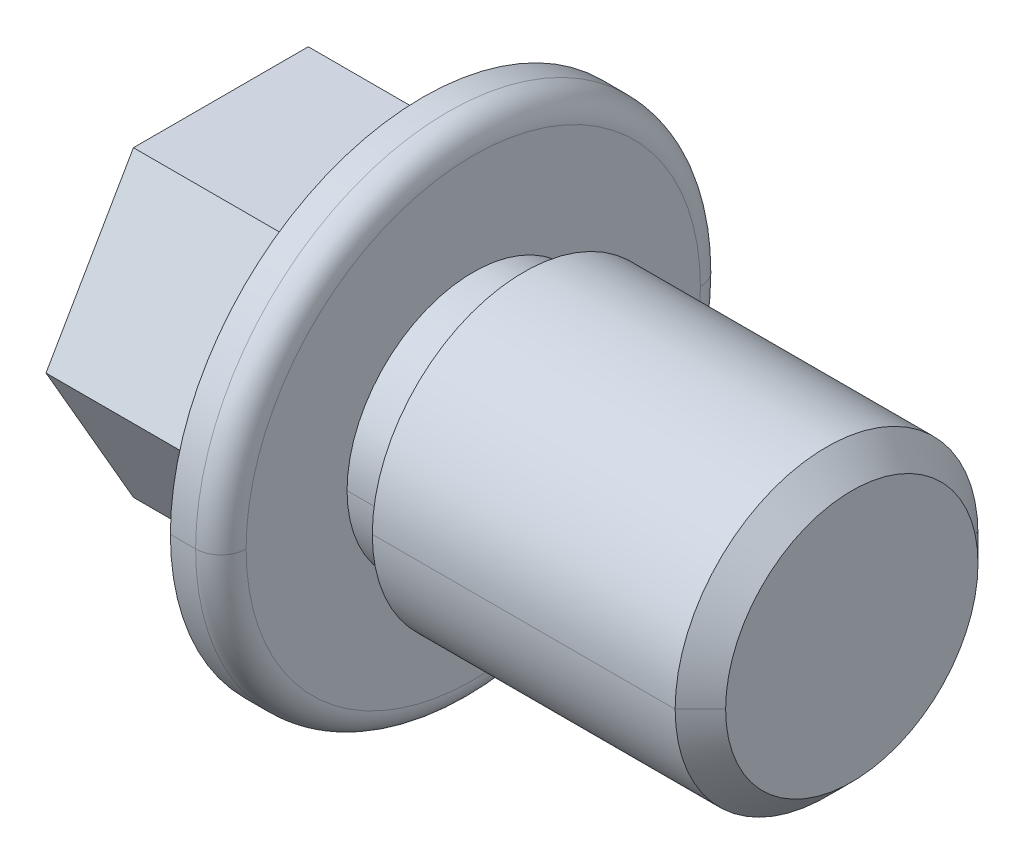
ISO-10303-21;
HEADER;
FILE_DESCRIPTION(('STEP AP214'),'2;1');
FILE_NAME('part.step','',(''),(''),'','','');
FILE_SCHEMA(('AUTOMOTIVE_DESIGN { 1 0 10303 214 1 1 1 1 }'));
ENDSEC;
DATA;
#1=APPLICATION_CONTEXT('core data for automotive mechanical design processes');
#2=APPLICATION_PROTOCOL_DEFINITION('international standard','automotive_design',2000,#1);
#3=PRODUCT_CONTEXT('',#1,'mechanical');
#4=PRODUCT('Part','Part','',(#3));
#5=PRODUCT_RELATED_PRODUCT_CATEGORY('part','',(#4));
#6=PRODUCT_DEFINITION_FORMATION('','',#4);
#7=PRODUCT_DEFINITION_CONTEXT('part definition',#1,'design');
#8=PRODUCT_DEFINITION('design','',#6,#7);
#9=PRODUCT_DEFINITION_SHAPE('','',#8);
#10=(LENGTH_UNIT() NAMED_UNIT(*) SI_UNIT(.MILLI.,.METRE.));
#11=(NAMED_UNIT(*) PLANE_ANGLE_UNIT() SI_UNIT($,.RADIAN.));
#12=(NAMED_UNIT(*) SI_UNIT($,.STERADIAN.) SOLID_ANGLE_UNIT());
#13=UNCERTAINTY_MEASURE_WITH_UNIT(LENGTH_MEASURE(1.E-05),#10,'distance_accuracy_value','');
#14=(GEOMETRIC_REPRESENTATION_CONTEXT(3) GLOBAL_UNCERTAINTY_ASSIGNED_CONTEXT((#13)) GLOBAL_UNIT_ASSIGNED_CONTEXT((#10,
#11,#12)) REPRESENTATION_CONTEXT('',''));
#15=CARTESIAN_POINT('',(0.,0.,0.));
#16=DIRECTION('',(0.,0.,1.));
#17=DIRECTION('',(1.,0.,0.));
#18=AXIS2_PLACEMENT_3D('',#15,#16,#17);
#19=CARTESIAN_POINT('',(-103.,-122.5,-62.));
#20=DIRECTION('',(1.,0.,0.));
#21=DIRECTION('',(0.,0.,-1.));
#22=AXIS2_PLACEMENT_3D('',#19,#20,#21);
#23=PLANE('',#22);
#24=CARTESIAN_POINT('',(-103.,-122.5,-62.));
#25=DIRECTION('',(1.,0.,0.));
#26=DIRECTION('',(0.,0.,-1.));
#27=AXIS2_PLACEMENT_3D('',#24,#25,#26);
#28=CIRCLE('',#27,6.);
#29=CARTESIAN_POINT('',(-103.,-122.5,-68.));
#30=VERTEX_POINT('',#29);
#31=CARTESIAN_POINT('',(-103.,-122.5,-56.));
#32=VERTEX_POINT('',#31);
#33=EDGE_CURVE('E137',#30,#32,#28,.T.);
#34=ORIENTED_EDGE('',*,*,#33,.F.);
#35=CARTESIAN_POINT('',(-103.,-122.5,-62.));
#36=DIRECTION('',(1.,0.,0.));
#37=DIRECTION('',(0.,0.,-1.));
#38=AXIS2_PLACEMENT_3D('',#35,#36,#37);
#39=CIRCLE('',#38,6.);
#40=EDGE_CURVE('E36',#32,#30,#39,.T.);
#41=ORIENTED_EDGE('',*,*,#40,.F.);
#42=EDGE_LOOP('',(#34,#41));
#43=FACE_BOUND('',#42,.T.);
#44=CARTESIAN_POINT('',(-103.,-122.5,-62.));
#45=DIRECTION('',(1.,0.,0.));
#46=DIRECTION('',(0.,0.,-1.));
#47=AXIS2_PLACEMENT_3D('',#44,#45,#46);
#48=CIRCLE('',#47,5.);
#49=CARTESIAN_POINT('',(-103.,-122.5,-67.));
#50=VERTEX_POINT('',#49);
#51=CARTESIAN_POINT('',(-103.,-122.5,-57.));
#52=VERTEX_POINT('',#51);
#53=EDGE_CURVE('E11',#50,#52,#48,.T.);
#54=ORIENTED_EDGE('',*,*,#53,.T.);
#55=CARTESIAN_POINT('',(-103.,-122.5,-62.));
#56=DIRECTION('',(1.,0.,0.));
#57=DIRECTION('',(0.,0.,-1.));
#58=AXIS2_PLACEMENT_3D('',#55,#56,#57);
#59=CIRCLE('',#58,5.);
#60=EDGE_CURVE('E27',#52,#50,#59,.T.);
#61=ORIENTED_EDGE('',*,*,#60,.T.);
#62=EDGE_LOOP('',(#54,#61));
#63=FACE_BOUND('',#62,.T.);
#64=ADVANCED_FACE('F17',(#43,#63),#23,.F.);
#65=CARTESIAN_POINT('',(-104.,-122.5,-62.));
#66=DIRECTION('',(1.,0.,0.));
#67=DIRECTION('',(0.,0.,1.));
#68=AXIS2_PLACEMENT_3D('',#65,#66,#67);
#69=CYLINDRICAL_SURFACE('',#68,5.);
#70=DIRECTION('',(1.,0.,0.));
#71=VECTOR('',#70,1.);
#72=CARTESIAN_POINT('',(-104.,-122.5,-57.));
#73=LINE('',#72,#71);
#74=CARTESIAN_POINT('',(-105.,-122.5,-57.));
#75=VERTEX_POINT('',#74);
#76=EDGE_CURVE('E158',#75,#52,#73,.T.);
#77=ORIENTED_EDGE('',*,*,#76,.F.);
#78=CARTESIAN_POINT('',(-105.,-122.5,-62.));
#79=DIRECTION('',(1.,0.,0.));
#80=DIRECTION('',(0.,0.,-1.));
#81=AXIS2_PLACEMENT_3D('',#78,#79,#80);
#82=CIRCLE('',#81,5.);
#83=CARTESIAN_POINT('',(-105.,-122.5,-67.));
#84=VERTEX_POINT('',#83);
#85=EDGE_CURVE('E157',#75,#84,#82,.T.);
#86=ORIENTED_EDGE('',*,*,#85,.T.);
#87=DIRECTION('',(1.,0.,0.));
#88=VECTOR('',#87,1.);
#89=CARTESIAN_POINT('',(-104.,-122.5,-67.));
#90=LINE('',#89,#88);
#91=EDGE_CURVE('E165',#84,#50,#90,.T.);
#92=ORIENTED_EDGE('',*,*,#91,.T.);
#93=ORIENTED_EDGE('',*,*,#60,.F.);
#94=EDGE_LOOP('',(#77,#86,#92,#93));
#95=FACE_BOUND('',#94,.T.);
#96=ADVANCED_FACE('F258',(#95),#69,.T.);
#97=CARTESIAN_POINT('',(-104.,-122.5,-62.));
#98=DIRECTION('',(1.,0.,0.));
#99=DIRECTION('',(0.,0.,1.));
#100=AXIS2_PLACEMENT_3D('',#97,#98,#99);
#101=CYLINDRICAL_SURFACE('',#100,5.);
#102=ORIENTED_EDGE('',*,*,#91,.F.);
#103=CARTESIAN_POINT('',(-105.,-122.5,-62.));
#104=DIRECTION('',(1.,0.,0.));
#105=DIRECTION('',(0.,0.,-1.));
#106=AXIS2_PLACEMENT_3D('',#103,#104,#105);
#107=CIRCLE('',#106,5.);
#108=EDGE_CURVE('E161',#84,#75,#107,.T.);
#109=ORIENTED_EDGE('',*,*,#108,.T.);
#110=ORIENTED_EDGE('',*,*,#76,.T.);
#111=ORIENTED_EDGE('',*,*,#53,.F.);
#112=EDGE_LOOP('',(#102,#109,#110,#111));
#113=FACE_BOUND('',#112,.T.);
#114=ADVANCED_FACE('F256',(#113),#101,.T.);
#115=CARTESIAN_POINT('',(-107.,-122.5,-62.));
#116=DIRECTION('',(-1.,0.,0.));
#117=DIRECTION('',(0.,0.,-1.));
#118=AXIS2_PLACEMENT_3D('',#115,#116,#117);
#119=PLANE('',#118);
#120=CARTESIAN_POINT('',(-107.,-122.5,-62.));
#121=DIRECTION('',(1.,0.,0.));
#122=DIRECTION('',(0.,0.,1.));
#123=AXIS2_PLACEMENT_3D('',#120,#121,#122);
#124=CIRCLE('',#123,10.);
#125=CARTESIAN_POINT('',(-107.,-122.5,-72.));
#126=VERTEX_POINT('',#125);
#127=CARTESIAN_POINT('',(-107.,-122.5,-52.));
#128=VERTEX_POINT('',#127);
#129=EDGE_CURVE('E170',#126,#128,#124,.T.);
#130=ORIENTED_EDGE('',*,*,#129,.F.);
#131=CARTESIAN_POINT('',(-107.,-122.5,-62.));
#132=DIRECTION('',(1.,0.,0.));
#133=DIRECTION('',(0.,0.,1.));
#134=AXIS2_PLACEMENT_3D('',#131,#132,#133);
#135=CIRCLE('',#134,10.);
#136=EDGE_CURVE('E174',#128,#126,#135,.T.);
#137=ORIENTED_EDGE('',*,*,#136,.F.);
#138=EDGE_LOOP('',(#130,#137));
#139=FACE_BOUND('',#138,.T.);
#140=DIRECTION('',(0.,-0.866025403784329,-0.50000000000019));
#141=VECTOR('',#140,1.);
#142=CARTESIAN_POINT('',(-107.,-119.5,-67.19615242271));
#143=LINE('',#142,#141);
#144=CARTESIAN_POINT('',(-107.,-116.5,-65.46410161514));
#145=VERTEX_POINT('',#144);
#146=CARTESIAN_POINT('',(-107.,-122.5,-68.92820323028));
#147=VERTEX_POINT('',#146);
#148=EDGE_CURVE('E162',#145,#147,#143,.T.);
#149=ORIENTED_EDGE('',*,*,#148,.F.);
#150=DIRECTION('',(0.,0.,-1.));
#151=VECTOR('',#150,1.);
#152=CARTESIAN_POINT('',(-107.,-116.5,-62.));
#153=LINE('',#152,#151);
#154=CARTESIAN_POINT('',(-107.,-116.5,-58.53589838486));
#155=VERTEX_POINT('',#154);
#156=EDGE_CURVE('E181',#155,#145,#153,.T.);
#157=ORIENTED_EDGE('',*,*,#156,.F.);
#158=DIRECTION('',(0.,0.866025403784329,-0.50000000000019));
#159=VECTOR('',#158,1.);
#160=CARTESIAN_POINT('',(-107.,-119.5,-56.80384757729));
#161=LINE('',#160,#159);
#162=CARTESIAN_POINT('',(-107.,-122.5,-55.07179676972));
#163=VERTEX_POINT('',#162);
#164=EDGE_CURVE('E184',#163,#155,#161,.T.);
#165=ORIENTED_EDGE('',*,*,#164,.F.);
#166=DIRECTION('',(0.,0.866025403784329,0.50000000000019));
#167=VECTOR('',#166,1.);
#168=CARTESIAN_POINT('',(-107.,-125.5,-56.80384757729));
#169=LINE('',#168,#167);
#170=CARTESIAN_POINT('',(-107.,-128.5,-58.53589838486));
#171=VERTEX_POINT('',#170);
#172=EDGE_CURVE('E187',#171,#163,#169,.T.);
#173=ORIENTED_EDGE('',*,*,#172,.F.);
#174=DIRECTION('',(0.,0.,1.));
#175=VECTOR('',#174,1.);
#176=CARTESIAN_POINT('',(-107.,-128.5,-62.));
#177=LINE('',#176,#175);
#178=CARTESIAN_POINT('',(-107.,-128.5,-65.46410161514));
#179=VERTEX_POINT('',#178);
#180=EDGE_CURVE('E190',#179,#171,#177,.T.);
#181=ORIENTED_EDGE('',*,*,#180,.F.);
#182=DIRECTION('',(0.,-0.866025403784329,0.50000000000019));
#183=VECTOR('',#182,1.);
#184=CARTESIAN_POINT('',(-107.,-125.5,-67.19615242271));
#185=LINE('',#184,#183);
#186=EDGE_CURVE('E193',#147,#179,#185,.T.);
#187=ORIENTED_EDGE('',*,*,#186,.F.);
#188=EDGE_LOOP('',(#149,#157,#165,#173,#181,#187));
#189=FACE_BOUND('',#188,.T.);
#190=ADVANCED_FACE('F271',(#139,#189),#119,.T.);
#191=CARTESIAN_POINT('',(-115.,-116.5,-65.46410161514));
#192=DIRECTION('',(0.,-0.50000000000019,0.866025403784329));
#193=DIRECTION('',(0.,0.866025403784329,0.50000000000019));
#194=AXIS2_PLACEMENT_3D('',#191,#192,#193);
#195=PLANE('',#194);
#196=ORIENTED_EDGE('',*,*,#148,.T.);
#197=DIRECTION('',(1.,0.,0.));
#198=VECTOR('',#197,1.);
#199=CARTESIAN_POINT('',(-111.,-122.5,-68.92820323028));
#200=LINE('',#199,#198);
#201=CARTESIAN_POINT('',(-115.,-122.5,-68.92820323028));
#202=VERTEX_POINT('',#201);
#203=EDGE_CURVE('E195',#202,#147,#200,.T.);
#204=ORIENTED_EDGE('',*,*,#203,.F.);
#205=DIRECTION('',(0.,-0.866025403784329,-0.50000000000019));
#206=VECTOR('',#205,1.);
#207=CARTESIAN_POINT('',(-115.,-119.5,-67.19615242271));
#208=LINE('',#207,#206);
#209=CARTESIAN_POINT('',(-115.,-116.5,-65.46410161514));
#210=VERTEX_POINT('',#209);
#211=EDGE_CURVE('E199',#210,#202,#208,.T.);
#212=ORIENTED_EDGE('',*,*,#211,.F.);
#213=DIRECTION('',(1.,0.,0.));
#214=VECTOR('',#213,1.);
#215=CARTESIAN_POINT('',(-111.,-116.5,-65.46410161514));
#216=LINE('',#215,#214);
#217=EDGE_CURVE('E180',#210,#145,#216,.T.);
#218=ORIENTED_EDGE('',*,*,#217,.T.);
#219=EDGE_LOOP('',(#196,#204,#212,#218));
#220=FACE_BOUND('',#219,.T.);
#221=ADVANCED_FACE('F274',(#220),#195,.F.);
#222=CARTESIAN_POINT('',(-115.,-116.5,-58.53589838486));
#223=DIRECTION('',(0.,-1.,0.));
#224=DIRECTION('',(0.,0.,1.));
#225=AXIS2_PLACEMENT_3D('',#222,#223,#224);
#226=PLANE('',#225);
#227=ORIENTED_EDGE('',*,*,#156,.T.);
#228=ORIENTED_EDGE('',*,*,#217,.F.);
#229=DIRECTION('',(0.,0.,-1.));
#230=VECTOR('',#229,1.);
#231=CARTESIAN_POINT('',(-115.,-116.5,-62.));
#232=LINE('',#231,#230);
#233=CARTESIAN_POINT('',(-115.,-116.5,-58.53589838486));
#234=VERTEX_POINT('',#233);
#235=EDGE_CURVE('E201',#234,#210,#232,.T.);
#236=ORIENTED_EDGE('',*,*,#235,.F.);
#237=DIRECTION('',(1.,0.,0.));
#238=VECTOR('',#237,1.);
#239=CARTESIAN_POINT('',(-111.,-116.5,-58.53589838486));
#240=LINE('',#239,#238);
#241=EDGE_CURVE('E183',#234,#155,#240,.T.);
#242=ORIENTED_EDGE('',*,*,#241,.T.);
#243=EDGE_LOOP('',(#227,#228,#236,#242));
#244=FACE_BOUND('',#243,.T.);
#245=ADVANCED_FACE('F278',(#244),#226,.F.);
#246=CARTESIAN_POINT('',(-115.,-122.5,-55.07179676972));
#247=DIRECTION('',(0.,-0.50000000000019,-0.866025403784329));
#248=DIRECTION('',(0.,-0.866025403784329,0.50000000000019));
#249=AXIS2_PLACEMENT_3D('',#246,#247,#248);
#250=PLANE('',#249);
#251=ORIENTED_EDGE('',*,*,#164,.T.);
#252=ORIENTED_EDGE('',*,*,#241,.F.);
#253=DIRECTION('',(0.,0.866025403784329,-0.50000000000019));
#254=VECTOR('',#253,1.);
#255=CARTESIAN_POINT('',(-115.,-119.5,-56.80384757729));
#256=LINE('',#255,#254);
#257=CARTESIAN_POINT('',(-115.,-122.5,-55.07179676972));
#258=VERTEX_POINT('',#257);
#259=EDGE_CURVE('E207',#258,#234,#256,.T.);
#260=ORIENTED_EDGE('',*,*,#259,.F.);
#261=DIRECTION('',(1.,0.,0.));
#262=VECTOR('',#261,1.);
#263=CARTESIAN_POINT('',(-111.,-122.5,-55.07179676972));
#264=LINE('',#263,#262);
#265=EDGE_CURVE('E186',#258,#163,#264,.T.);
#266=ORIENTED_EDGE('',*,*,#265,.T.);
#267=EDGE_LOOP('',(#251,#252,#260,#266));
#268=FACE_BOUND('',#267,.T.);
#269=ADVANCED_FACE('F282',(#268),#250,.F.);
#270=CARTESIAN_POINT('',(-115.,-128.5,-58.53589838486));
#271=DIRECTION('',(0.,0.50000000000019,-0.866025403784329));
#272=DIRECTION('',(0.,-0.866025403784329,-0.50000000000019));
#273=AXIS2_PLACEMENT_3D('',#270,#271,#272);
#274=PLANE('',#273);
#275=ORIENTED_EDGE('',*,*,#172,.T.);
#276=ORIENTED_EDGE('',*,*,#265,.F.);
#277=DIRECTION('',(0.,0.866025403784329,0.50000000000019));
#278=VECTOR('',#277,1.);
#279=CARTESIAN_POINT('',(-115.,-125.5,-56.80384757729));
#280=LINE('',#279,#278);
#281=CARTESIAN_POINT('',(-115.,-128.5,-58.53589838486));
#282=VERTEX_POINT('',#281);
#283=EDGE_CURVE('E212',#282,#258,#280,.T.);
#284=ORIENTED_EDGE('',*,*,#283,.F.);
#285=DIRECTION('',(1.,0.,0.));
#286=VECTOR('',#285,1.);
#287=CARTESIAN_POINT('',(-111.,-128.5,-58.53589838486));
#288=LINE('',#287,#286);
#289=EDGE_CURVE('E189',#282,#171,#288,.T.);
#290=ORIENTED_EDGE('',*,*,#289,.T.);
#291=EDGE_LOOP('',(#275,#276,#284,#290));
#292=FACE_BOUND('',#291,.T.);
#293=ADVANCED_FACE('F286',(#292),#274,.F.);
#294=CARTESIAN_POINT('',(-115.,-128.5,-65.46410161514));
#295=DIRECTION('',(0.,1.,0.));
#296=DIRECTION('',(0.,0.,-1.));
#297=AXIS2_PLACEMENT_3D('',#294,#295,#296);
#298=PLANE('',#297);
#299=ORIENTED_EDGE('',*,*,#180,.T.);
#300=ORIENTED_EDGE('',*,*,#289,.F.);
#301=DIRECTION('',(0.,0.,1.));
#302=VECTOR('',#301,1.);
#303=CARTESIAN_POINT('',(-115.,-128.5,-62.));
#304=LINE('',#303,#302);
#305=CARTESIAN_POINT('',(-115.,-128.5,-65.46410161514));
#306=VERTEX_POINT('',#305);
#307=EDGE_CURVE('E198',#306,#282,#304,.T.);
#308=ORIENTED_EDGE('',*,*,#307,.F.);
#309=DIRECTION('',(1.,0.,0.));
#310=VECTOR('',#309,1.);
#311=CARTESIAN_POINT('',(-111.,-128.5,-65.46410161514));
#312=LINE('',#311,#310);
#313=EDGE_CURVE('E192',#306,#179,#312,.T.);
#314=ORIENTED_EDGE('',*,*,#313,.T.);
#315=EDGE_LOOP('',(#299,#300,#308,#314));
#316=FACE_BOUND('',#315,.T.);
#317=ADVANCED_FACE('F290',(#316),#298,.F.);
#318=CARTESIAN_POINT('',(-115.,-122.5,-68.92820323028));
#319=DIRECTION('',(0.,0.50000000000019,0.866025403784329));
#320=DIRECTION('',(0.,0.866025403784329,-0.50000000000019));
#321=AXIS2_PLACEMENT_3D('',#318,#319,#320);
#322=PLANE('',#321);
#323=ORIENTED_EDGE('',*,*,#186,.T.);
#324=ORIENTED_EDGE('',*,*,#313,.F.);
#325=DIRECTION('',(0.,-0.866025403784329,0.50000000000019));
#326=VECTOR('',#325,1.);
#327=CARTESIAN_POINT('',(-115.,-125.5,-67.19615242271));
#328=LINE('',#327,#326);
#329=EDGE_CURVE('E202',#202,#306,#328,.T.);
#330=ORIENTED_EDGE('',*,*,#329,.F.);
#331=ORIENTED_EDGE('',*,*,#203,.T.);
#332=EDGE_LOOP('',(#323,#324,#330,#331));
#333=FACE_BOUND('',#332,.T.);
#334=ADVANCED_FACE('F294',(#333),#322,.F.);
#335=CARTESIAN_POINT('',(-115.,-122.5,-62.));
#336=DIRECTION('',(-1.,0.,0.));
#337=DIRECTION('',(0.,0.,-1.));
#338=AXIS2_PLACEMENT_3D('',#335,#336,#337);
#339=PLANE('',#338);
#340=ORIENTED_EDGE('',*,*,#307,.T.);
#341=ORIENTED_EDGE('',*,*,#283,.T.);
#342=ORIENTED_EDGE('',*,*,#259,.T.);
#343=ORIENTED_EDGE('',*,*,#235,.T.);
#344=ORIENTED_EDGE('',*,*,#211,.T.);
#345=ORIENTED_EDGE('',*,*,#329,.T.);
#346=EDGE_LOOP('',(#340,#341,#342,#343,#344,#345));
#347=FACE_BOUND('',#346,.T.);
#348=ADVANCED_FACE('F250',(#347),#339,.T.);
#349=CARTESIAN_POINT('',(-105.,-122.5,-62.));
#350=DIRECTION('',(1.,0.,0.));
#351=DIRECTION('',(0.,0.,1.));
#352=AXIS2_PLACEMENT_3D('',#349,#350,#351);
#353=PLANE('',#352);
#354=CARTESIAN_POINT('',(-105.,-122.5,-62.));
#355=DIRECTION('',(1.,0.,0.));
#356=DIRECTION('',(0.,0.,-1.));
#357=AXIS2_PLACEMENT_3D('',#354,#355,#356);
#358=CIRCLE('',#357,9.);
#359=CARTESIAN_POINT('',(-105.,-122.5,-53.));
#360=VERTEX_POINT('',#359);
#361=CARTESIAN_POINT('',(-105.,-122.499999533447,-71.));
#362=VERTEX_POINT('',#361);
#363=EDGE_CURVE('E225',#360,#362,#358,.T.);
#364=ORIENTED_EDGE('',*,*,#363,.T.);
#365=CARTESIAN_POINT('',(-105.,-122.5,-62.));
#366=DIRECTION('',(1.,0.,0.));
#367=DIRECTION('',(0.,0.,-1.));
#368=AXIS2_PLACEMENT_3D('',#365,#366,#367);
#369=CIRCLE('',#368,9.);
#370=EDGE_CURVE('E177',#362,#360,#369,.T.);
#371=ORIENTED_EDGE('',*,*,#370,.T.);
#372=EDGE_LOOP('',(#364,#371));
#373=FACE_BOUND('',#372,.T.);
#374=ORIENTED_EDGE('',*,*,#85,.F.);
#375=ORIENTED_EDGE('',*,*,#108,.F.);
#376=EDGE_LOOP('',(#374,#375));
#377=FACE_BOUND('',#376,.T.);
#378=ADVANCED_FACE('F246',(#373,#377),#353,.T.);
#379=CARTESIAN_POINT('',(-106.,-122.5,-62.));
#380=DIRECTION('',(1.,0.,0.));
#381=DIRECTION('',(0.,0.,1.));
#382=AXIS2_PLACEMENT_3D('',#379,#380,#381);
#383=CYLINDRICAL_SURFACE('',#382,10.);
#384=DIRECTION('',(1.,0.,0.));
#385=VECTOR('',#384,1.);
#386=CARTESIAN_POINT('',(-106.,-122.5,-52.));
#387=LINE('',#386,#385);
#388=CARTESIAN_POINT('',(-106.,-122.5,-52.));
#389=VERTEX_POINT('',#388);
#390=EDGE_CURVE('E173',#128,#389,#387,.T.);
#391=ORIENTED_EDGE('',*,*,#390,.F.);
#392=ORIENTED_EDGE('',*,*,#136,.T.);
#393=DIRECTION('',(1.,0.,0.));
#394=VECTOR('',#393,1.);
#395=CARTESIAN_POINT('',(-106.,-122.5,-72.));
#396=LINE('',#395,#394);
#397=CARTESIAN_POINT('',(-106.,-122.5,-72.));
#398=VERTEX_POINT('',#397);
#399=EDGE_CURVE('E172',#126,#398,#396,.T.);
#400=ORIENTED_EDGE('',*,*,#399,.T.);
#401=CARTESIAN_POINT('',(-106.,-122.5,-62.));
#402=DIRECTION('',(1.,0.,0.));
#403=DIRECTION('',(0.,0.,-1.));
#404=AXIS2_PLACEMENT_3D('',#401,#402,#403);
#405=CIRCLE('',#404,10.);
#406=EDGE_CURVE('E231',#389,#398,#405,.T.);
#407=ORIENTED_EDGE('',*,*,#406,.F.);
#408=EDGE_LOOP('',(#391,#392,#400,#407));
#409=FACE_BOUND('',#408,.T.);
#410=ADVANCED_FACE('F249',(#409),#383,.T.);
#411=CARTESIAN_POINT('',(-106.,-122.5,-62.));
#412=DIRECTION('',(1.,0.,0.));
#413=DIRECTION('',(0.,0.,1.));
#414=AXIS2_PLACEMENT_3D('',#411,#412,#413);
#415=CYLINDRICAL_SURFACE('',#414,10.);
#416=ORIENTED_EDGE('',*,*,#399,.F.);
#417=ORIENTED_EDGE('',*,*,#129,.T.);
#418=ORIENTED_EDGE('',*,*,#390,.T.);
#419=CARTESIAN_POINT('',(-106.,-122.5,-62.));
#420=DIRECTION('',(1.,0.,0.));
#421=DIRECTION('',(0.,0.,-1.));
#422=AXIS2_PLACEMENT_3D('',#419,#420,#421);
#423=CIRCLE('',#422,10.);
#424=EDGE_CURVE('E148',#398,#389,#423,.T.);
#425=ORIENTED_EDGE('',*,*,#424,.F.);
#426=EDGE_LOOP('',(#416,#417,#418,#425));
#427=FACE_BOUND('',#426,.T.);
#428=ADVANCED_FACE('F304',(#427),#415,.T.);
#429=CARTESIAN_POINT('',(-106.,-122.5,-62.));
#430=DIRECTION('',(1.,0.,0.));
#431=DIRECTION('',(0.,0.,-1.));
#432=AXIS2_PLACEMENT_3D('',#429,#430,#431);
#433=TOROIDAL_SURFACE('',#432,9.,1.);
#434=CARTESIAN_POINT('',(-106.,-122.5,-53.));
#435=DIRECTION('',(0.,1.,0.));
#436=DIRECTION('',(0.,0.,1.));
#437=AXIS2_PLACEMENT_3D('',#434,#435,#436);
#438=CIRCLE('',#437,1.);
#439=EDGE_CURVE('E145',#389,#360,#438,.T.);
#440=ORIENTED_EDGE('',*,*,#439,.F.);
#441=ORIENTED_EDGE('',*,*,#406,.T.);
#442=CARTESIAN_POINT('',(-106.,-122.5,-71.));
#443=DIRECTION('',(0.,-1.,0.));
#444=DIRECTION('',(0.,0.,1.));
#445=AXIS2_PLACEMENT_3D('',#442,#443,#444);
#446=CIRCLE('',#445,1.);
#447=EDGE_CURVE('E151',#398,#362,#446,.T.);
#448=ORIENTED_EDGE('',*,*,#447,.T.);
#449=ORIENTED_EDGE('',*,*,#363,.F.);
#450=EDGE_LOOP('',(#440,#441,#448,#449));
#451=FACE_BOUND('',#450,.T.);
#452=ADVANCED_FACE('F243',(#451),#433,.T.);
#453=CARTESIAN_POINT('',(-106.,-122.5,-62.));
#454=DIRECTION('',(1.,0.,0.));
#455=DIRECTION('',(0.,0.447555956613777,0.894255928523556));
#456=AXIS2_PLACEMENT_3D('',#453,#454,#455);
#457=TOROIDAL_SURFACE('',#456,9.,1.);
#458=ORIENTED_EDGE('',*,*,#447,.F.);
#459=ORIENTED_EDGE('',*,*,#424,.T.);
#460=ORIENTED_EDGE('',*,*,#439,.T.);
#461=ORIENTED_EDGE('',*,*,#370,.F.);
#462=EDGE_LOOP('',(#458,#459,#460,#461));
#463=FACE_BOUND('',#462,.T.);
#464=ADVANCED_FACE('F244',(#463),#457,.T.);
#465=CARTESIAN_POINT('',(-90.,-122.5,-62.));
#466=DIRECTION('',(1.,0.,0.));
#467=DIRECTION('',(0.,0.,1.));
#468=AXIS2_PLACEMENT_3D('',#465,#466,#467);
#469=PLANE('',#468);
#470=CARTESIAN_POINT('',(-90.,-122.5,-62.));
#471=DIRECTION('',(1.,0.,0.));
#472=DIRECTION('',(0.,0.,-1.));
#473=AXIS2_PLACEMENT_3D('',#470,#471,#472);
#474=CIRCLE('',#473,5.);
#475=CARTESIAN_POINT('',(-90.,-122.500000006072,-67.));
#476=VERTEX_POINT('',#475);
#477=CARTESIAN_POINT('',(-90.,-122.5,-57.));
#478=VERTEX_POINT('',#477);
#479=EDGE_CURVE('E142',#476,#478,#474,.T.);
#480=ORIENTED_EDGE('',*,*,#479,.T.);
#481=CARTESIAN_POINT('',(-90.,-122.5,-62.));
#482=DIRECTION('',(1.,0.,0.));
#483=DIRECTION('',(0.,0.,-1.));
#484=AXIS2_PLACEMENT_3D('',#481,#482,#483);
#485=CIRCLE('',#484,5.);
#486=EDGE_CURVE('E139',#478,#476,#485,.T.);
#487=ORIENTED_EDGE('',*,*,#486,.T.);
#488=EDGE_LOOP('',(#480,#487));
#489=FACE_BOUND('',#488,.T.);
#490=ADVANCED_FACE('F144',(#489),#469,.T.);
#491=CARTESIAN_POINT('',(-96.5,-122.5,-62.));
#492=DIRECTION('',(1.,0.,0.));
#493=DIRECTION('',(0.,0.,1.));
#494=AXIS2_PLACEMENT_3D('',#491,#492,#493);
#495=CYLINDRICAL_SURFACE('',#494,6.);
#496=DIRECTION('',(-1.,0.,0.));
#497=VECTOR('',#496,1.);
#498=CARTESIAN_POINT('',(-96.5,-122.5,-68.));
#499=LINE('',#498,#497);
#500=CARTESIAN_POINT('',(-91.,-122.5,-68.));
#501=VERTEX_POINT('',#500);
#502=EDGE_CURVE('E124',#501,#30,#499,.T.);
#503=ORIENTED_EDGE('',*,*,#502,.T.);
#504=ORIENTED_EDGE('',*,*,#33,.T.);
#505=DIRECTION('',(-1.,0.,0.));
#506=VECTOR('',#505,1.);
#507=CARTESIAN_POINT('',(-96.5,-122.5,-56.));
#508=LINE('',#507,#506);
#509=CARTESIAN_POINT('',(-91.,-122.5,-56.));
#510=VERTEX_POINT('',#509);
#511=EDGE_CURVE('E122',#510,#32,#508,.T.);
#512=ORIENTED_EDGE('',*,*,#511,.F.);
#513=CARTESIAN_POINT('',(-91.,-122.5,-62.));
#514=DIRECTION('',(1.,0.,0.));
#515=DIRECTION('',(0.,0.,-1.));
#516=AXIS2_PLACEMENT_3D('',#513,#514,#515);
#517=CIRCLE('',#516,6.);
#518=EDGE_CURVE('E129',#501,#510,#517,.T.);
#519=ORIENTED_EDGE('',*,*,#518,.F.);
#520=EDGE_LOOP('',(#503,#504,#512,#519));
#521=FACE_BOUND('',#520,.T.);
#522=ADVANCED_FACE('F136',(#521),#495,.T.);
#523=CARTESIAN_POINT('',(-96.5,-122.5,-62.));
#524=DIRECTION('',(1.,0.,0.));
#525=DIRECTION('',(0.,0.,1.));
#526=AXIS2_PLACEMENT_3D('',#523,#524,#525);
#527=CYLINDRICAL_SURFACE('',#526,6.);
#528=ORIENTED_EDGE('',*,*,#511,.T.);
#529=ORIENTED_EDGE('',*,*,#40,.T.);
#530=ORIENTED_EDGE('',*,*,#502,.F.);
#531=CARTESIAN_POINT('',(-91.,-122.5,-62.));
#532=DIRECTION('',(1.,0.,0.));
#533=DIRECTION('',(0.,0.,-1.));
#534=AXIS2_PLACEMENT_3D('',#531,#532,#533);
#535=CIRCLE('',#534,6.);
#536=EDGE_CURVE('E117',#510,#501,#535,.T.);
#537=ORIENTED_EDGE('',*,*,#536,.F.);
#538=EDGE_LOOP('',(#528,#529,#530,#537));
#539=FACE_BOUND('',#538,.T.);
#540=ADVANCED_FACE('F120',(#539),#527,.T.);
#541=CARTESIAN_POINT('',(-85.,-122.5,-62.));
#542=DIRECTION('',(-1.,0.,0.));
#543=DIRECTION('',(0.,-0.0955812586192965,-0.995421630767963));
#544=AXIS2_PLACEMENT_3D('',#541,#542,#543);
#545=CONICAL_SURFACE('',#544,0.,0.785398163396999);
#546=DIRECTION('',(-0.707106781186548,0.,-0.707106781186548));
#547=VECTOR('',#546,1.);
#548=CARTESIAN_POINT('',(-90.5,-122.5,-67.5));
#549=LINE('',#548,#547);
#550=EDGE_CURVE('E132',#476,#501,#549,.T.);
#551=ORIENTED_EDGE('',*,*,#550,.T.);
#552=ORIENTED_EDGE('',*,*,#518,.T.);
#553=DIRECTION('',(-0.707106781186548,0.,0.707106781186548));
#554=VECTOR('',#553,1.);
#555=CARTESIAN_POINT('',(-90.5,-122.5,-56.5));
#556=LINE('',#555,#554);
#557=EDGE_CURVE('E21',#478,#510,#556,.T.);
#558=ORIENTED_EDGE('',*,*,#557,.F.);
#559=ORIENTED_EDGE('',*,*,#479,.F.);
#560=EDGE_LOOP('',(#551,#552,#558,#559));
#561=FACE_BOUND('',#560,.T.);
#562=ADVANCED_FACE('F130',(#561),#545,.T.);
#563=CARTESIAN_POINT('',(-85.,-122.5,-62.));
#564=DIRECTION('',(-1.,0.,0.));
#565=DIRECTION('',(0.,0.,1.));
#566=AXIS2_PLACEMENT_3D('',#563,#564,#565);
#567=CONICAL_SURFACE('',#566,0.,0.785398163396999);
#568=ORIENTED_EDGE('',*,*,#557,.T.);
#569=ORIENTED_EDGE('',*,*,#536,.T.);
#570=ORIENTED_EDGE('',*,*,#550,.F.);
#571=ORIENTED_EDGE('',*,*,#486,.F.);
#572=EDGE_LOOP('',(#568,#569,#570,#571));
#573=FACE_BOUND('',#572,.T.);
#574=ADVANCED_FACE('F19',(#573),#567,.T.);
#575=CLOSED_SHELL('',(#64,#96,#114,#190,#221,#245,#269,#293,#317,#334,#348,#378,#410,#428,#452,
#464,#490,#522,#540,#562,#574));
#576=MANIFOLD_SOLID_BREP('B1',#575);
#577=ADVANCED_BREP_SHAPE_REPRESENTATION('',(#18,#576),#14);
#578=SHAPE_DEFINITION_REPRESENTATION(#9,#577);
ENDSEC;
END-ISO-10303-21;
